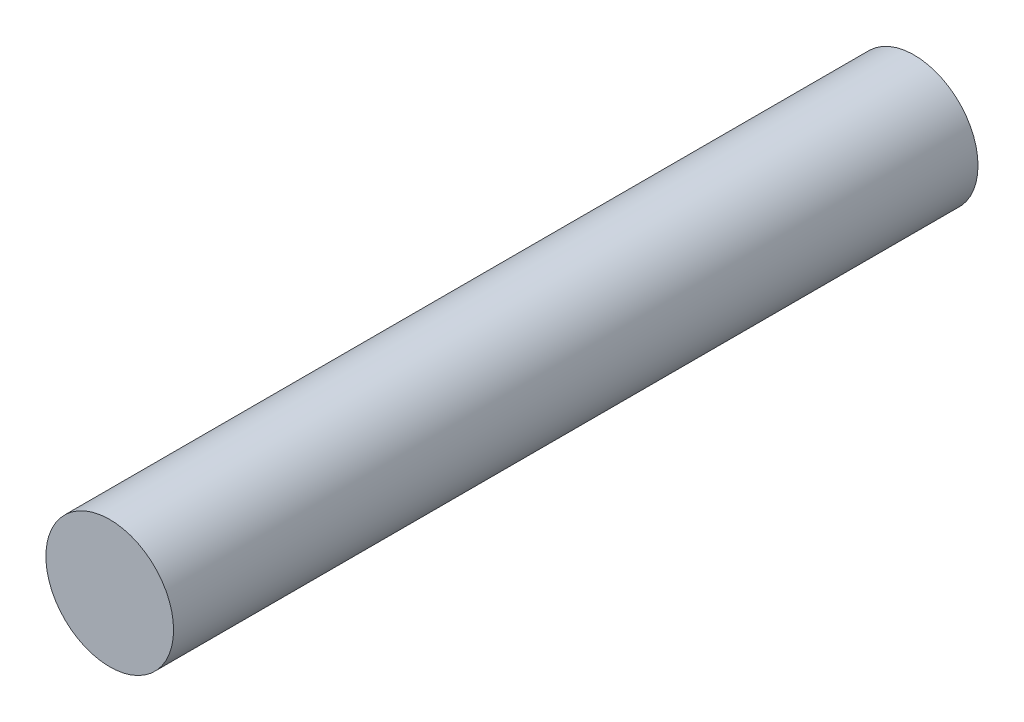
ISO-10303-21;
HEADER;
FILE_DESCRIPTION(('STEP AP214'),'2;1');
FILE_NAME('part.step','',(''),(''),'','','');
FILE_SCHEMA(('AUTOMOTIVE_DESIGN { 1 0 10303 214 1 1 1 1 }'));
ENDSEC;
DATA;
#1=APPLICATION_CONTEXT('core data for automotive mechanical design processes');
#2=APPLICATION_PROTOCOL_DEFINITION('international standard','automotive_design',2000,#1);
#3=PRODUCT_CONTEXT('',#1,'mechanical');
#4=PRODUCT('Part','Part','',(#3));
#5=PRODUCT_RELATED_PRODUCT_CATEGORY('part','',(#4));
#6=PRODUCT_DEFINITION_FORMATION('','',#4);
#7=PRODUCT_DEFINITION_CONTEXT('part definition',#1,'design');
#8=PRODUCT_DEFINITION('design','',#6,#7);
#9=PRODUCT_DEFINITION_SHAPE('','',#8);
#10=(LENGTH_UNIT() NAMED_UNIT(*) SI_UNIT(.MILLI.,.METRE.));
#11=(NAMED_UNIT(*) PLANE_ANGLE_UNIT() SI_UNIT($,.RADIAN.));
#12=(NAMED_UNIT(*) SI_UNIT($,.STERADIAN.) SOLID_ANGLE_UNIT());
#13=UNCERTAINTY_MEASURE_WITH_UNIT(LENGTH_MEASURE(1.E-05),#10,'distance_accuracy_value','');
#14=(GEOMETRIC_REPRESENTATION_CONTEXT(3) GLOBAL_UNCERTAINTY_ASSIGNED_CONTEXT((#13)) GLOBAL_UNIT_ASSIGNED_CONTEXT((#10,
#11,#12)) REPRESENTATION_CONTEXT('',''));
#15=CARTESIAN_POINT('',(0.,0.,0.));
#16=DIRECTION('',(0.,0.,1.));
#17=DIRECTION('',(1.,0.,0.));
#18=AXIS2_PLACEMENT_3D('',#15,#16,#17);
#19=CARTESIAN_POINT('',(0.,0.,31.5));
#20=DIRECTION('',(0.,0.,-1.));
#21=DIRECTION('',(-1.,0.,0.));
#22=AXIS2_PLACEMENT_3D('',#19,#20,#21);
#23=CYLINDRICAL_SURFACE('',#22,2.5);
#24=CARTESIAN_POINT('',(0.,0.,31.5));
#25=DIRECTION('',(0.,0.,1.));
#26=DIRECTION('',(1.,0.,0.));
#27=AXIS2_PLACEMENT_3D('',#24,#25,#26);
#28=CIRCLE('',#27,2.5);
#29=CARTESIAN_POINT('',(2.5,0.,31.5));
#30=VERTEX_POINT('',#29);
#31=EDGE_CURVE('E10',#30,#30,#28,.T.);
#32=ORIENTED_EDGE('',*,*,#31,.F.);
#33=EDGE_LOOP('',(#32));
#34=FACE_BOUND('',#33,.T.);
#35=CARTESIAN_POINT('',(0.,0.,0.));
#36=DIRECTION('',(0.,0.,1.));
#37=DIRECTION('',(1.,0.,0.));
#38=AXIS2_PLACEMENT_3D('',#35,#36,#37);
#39=CIRCLE('',#38,2.5);
#40=CARTESIAN_POINT('',(2.5,0.,0.));
#41=VERTEX_POINT('',#40);
#42=EDGE_CURVE('E36',#41,#41,#39,.T.);
#43=ORIENTED_EDGE('',*,*,#42,.T.);
#44=EDGE_LOOP('',(#43));
#45=FACE_BOUND('',#44,.T.);
#46=ADVANCED_FACE('F33',(#34,#45),#23,.T.);
#47=CARTESIAN_POINT('',(0.,0.,31.5));
#48=DIRECTION('',(0.,0.,1.));
#49=DIRECTION('',(1.,0.,0.));
#50=AXIS2_PLACEMENT_3D('',#47,#48,#49);
#51=PLANE('',#50);
#52=ORIENTED_EDGE('',*,*,#31,.T.);
#53=EDGE_LOOP('',(#52));
#54=FACE_BOUND('',#53,.T.);
#55=ADVANCED_FACE('F48',(#54),#51,.T.);
#56=CARTESIAN_POINT('',(0.,0.,0.));
#57=DIRECTION('',(0.,0.,1.));
#58=DIRECTION('',(1.,0.,0.));
#59=AXIS2_PLACEMENT_3D('',#56,#57,#58);
#60=PLANE('',#59);
#61=ORIENTED_EDGE('',*,*,#42,.F.);
#62=EDGE_LOOP('',(#61));
#63=FACE_BOUND('',#62,.T.);
#64=ADVANCED_FACE('F46',(#63),#60,.F.);
#65=CLOSED_SHELL('',(#46,#55,#64));
#66=MANIFOLD_SOLID_BREP('B2',#65);
#67=ADVANCED_BREP_SHAPE_REPRESENTATION('',(#18,#66),#14);
#68=SHAPE_DEFINITION_REPRESENTATION(#9,#67);
ENDSEC;
END-ISO-10303-21;
